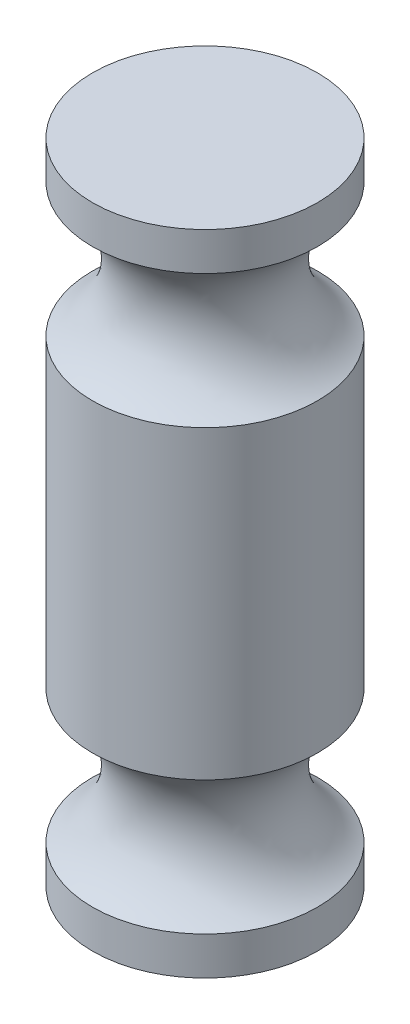
ISO-10303-21;
HEADER;
FILE_DESCRIPTION(('STEP AP214'),'2;1');
FILE_NAME('part.step','',(''),(''),'','','');
FILE_SCHEMA(('AUTOMOTIVE_DESIGN { 1 0 10303 214 1 1 1 1 }'));
ENDSEC;
DATA;
#1=APPLICATION_CONTEXT('core data for automotive mechanical design processes');
#2=APPLICATION_PROTOCOL_DEFINITION('international standard','automotive_design',2000,#1);
#3=PRODUCT_CONTEXT('',#1,'mechanical');
#4=PRODUCT('Part','Part','',(#3));
#5=PRODUCT_RELATED_PRODUCT_CATEGORY('part','',(#4));
#6=PRODUCT_DEFINITION_FORMATION('','',#4);
#7=PRODUCT_DEFINITION_CONTEXT('part definition',#1,'design');
#8=PRODUCT_DEFINITION('design','',#6,#7);
#9=PRODUCT_DEFINITION_SHAPE('','',#8);
#10=(LENGTH_UNIT() NAMED_UNIT(*) SI_UNIT(.MILLI.,.METRE.));
#11=(NAMED_UNIT(*) PLANE_ANGLE_UNIT() SI_UNIT($,.RADIAN.));
#12=(NAMED_UNIT(*) SI_UNIT($,.STERADIAN.) SOLID_ANGLE_UNIT());
#13=UNCERTAINTY_MEASURE_WITH_UNIT(LENGTH_MEASURE(1.E-05),#10,'distance_accuracy_value','');
#14=(GEOMETRIC_REPRESENTATION_CONTEXT(3) GLOBAL_UNCERTAINTY_ASSIGNED_CONTEXT((#13)) GLOBAL_UNIT_ASSIGNED_CONTEXT((#10,
#11,#12)) REPRESENTATION_CONTEXT('',''));
#15=CARTESIAN_POINT('',(0.,0.,0.));
#16=DIRECTION('',(0.,0.,1.));
#17=DIRECTION('',(1.,0.,0.));
#18=AXIS2_PLACEMENT_3D('',#15,#16,#17);
#19=CARTESIAN_POINT('',(2.95,-8.44,0.));
#20=DIRECTION('',(0.,-1.,0.));
#21=DIRECTION('',(0.,0.,-1.));
#22=AXIS2_PLACEMENT_3D('',#19,#20,#21);
#23=PLANE('',#22);
#24=CARTESIAN_POINT('',(0.,-8.44,0.));
#25=DIRECTION('',(0.,-1.,0.));
#26=DIRECTION('',(0.,0.,-1.));
#27=AXIS2_PLACEMENT_3D('',#24,#25,#26);
#28=CIRCLE('',#27,2.95);
#29=CARTESIAN_POINT('',(0.,-8.44,-2.95));
#30=VERTEX_POINT('',#29);
#31=EDGE_CURVE('E10',#30,#30,#28,.T.);
#32=ORIENTED_EDGE('',*,*,#31,.T.);
#33=EDGE_LOOP('',(#32));
#34=FACE_BOUND('',#33,.T.);
#35=ADVANCED_FACE('F34',(#34),#23,.T.);
#36=CARTESIAN_POINT('',(0.,-8.44,0.));
#37=DIRECTION('',(0.,-1.,0.));
#38=DIRECTION('',(0.,0.,-1.));
#39=AXIS2_PLACEMENT_3D('',#36,#37,#38);
#40=CYLINDRICAL_SURFACE('',#39,2.95);
#41=CARTESIAN_POINT('',(0.,-7.44,0.));
#42=DIRECTION('',(0.,-1.,0.));
#43=DIRECTION('',(0.,0.,-1.));
#44=AXIS2_PLACEMENT_3D('',#41,#42,#43);
#45=CIRCLE('',#44,2.95);
#46=CARTESIAN_POINT('',(0.,-7.44,-2.95));
#47=VERTEX_POINT('',#46);
#48=EDGE_CURVE('E40',#47,#47,#45,.T.);
#49=ORIENTED_EDGE('',*,*,#48,.T.);
#50=EDGE_LOOP('',(#49));
#51=FACE_BOUND('',#50,.T.);
#52=ORIENTED_EDGE('',*,*,#31,.F.);
#53=EDGE_LOOP('',(#52));
#54=FACE_BOUND('',#53,.T.);
#55=ADVANCED_FACE('F72',(#51,#54),#40,.T.);
#56=CARTESIAN_POINT('',(0.,-5.69,0.));
#57=DIRECTION('',(0.,-1.,0.));
#58=DIRECTION('',(0.,0.,-1.));
#59=AXIS2_PLACEMENT_3D('',#56,#57,#58);
#60=TOROIDAL_SURFACE('',#59,3.91824583655186,2.);
#61=CARTESIAN_POINT('',(0.,-3.94,0.));
#62=DIRECTION('',(0.,-1.,0.));
#63=DIRECTION('',(0.,0.,-1.));
#64=AXIS2_PLACEMENT_3D('',#61,#62,#63);
#65=CIRCLE('',#64,2.95);
#66=CARTESIAN_POINT('',(0.,-3.94,-2.95));
#67=VERTEX_POINT('',#66);
#68=EDGE_CURVE('E44',#67,#67,#65,.T.);
#69=ORIENTED_EDGE('',*,*,#68,.T.);
#70=EDGE_LOOP('',(#69));
#71=FACE_BOUND('',#70,.T.);
#72=ORIENTED_EDGE('',*,*,#48,.F.);
#73=EDGE_LOOP('',(#72));
#74=FACE_BOUND('',#73,.T.);
#75=ADVANCED_FACE('F76',(#71,#74),#60,.F.);
#76=CARTESIAN_POINT('',(0.,-8.44,0.));
#77=DIRECTION('',(0.,-1.,0.));
#78=DIRECTION('',(0.,0.,-1.));
#79=AXIS2_PLACEMENT_3D('',#76,#77,#78);
#80=CYLINDRICAL_SURFACE('',#79,2.95);
#81=CARTESIAN_POINT('',(0.,4.06,0.));
#82=DIRECTION('',(0.,-1.,0.));
#83=DIRECTION('',(0.,0.,-1.));
#84=AXIS2_PLACEMENT_3D('',#81,#82,#83);
#85=CIRCLE('',#84,2.95);
#86=CARTESIAN_POINT('',(0.,4.06,-2.95));
#87=VERTEX_POINT('',#86);
#88=EDGE_CURVE('E48',#87,#87,#85,.T.);
#89=ORIENTED_EDGE('',*,*,#88,.T.);
#90=EDGE_LOOP('',(#89));
#91=FACE_BOUND('',#90,.T.);
#92=ORIENTED_EDGE('',*,*,#68,.F.);
#93=EDGE_LOOP('',(#92));
#94=FACE_BOUND('',#93,.T.);
#95=ADVANCED_FACE('F80',(#91,#94),#80,.T.);
#96=CARTESIAN_POINT('',(0.,5.81,0.));
#97=DIRECTION('',(0.,-1.,0.));
#98=DIRECTION('',(0.,0.,-1.));
#99=AXIS2_PLACEMENT_3D('',#96,#97,#98);
#100=TOROIDAL_SURFACE('',#99,3.91824583655185,2.);
#101=CARTESIAN_POINT('',(0.,7.56,0.));
#102=DIRECTION('',(0.,-1.,0.));
#103=DIRECTION('',(0.,0.,-1.));
#104=AXIS2_PLACEMENT_3D('',#101,#102,#103);
#105=CIRCLE('',#104,2.95);
#106=CARTESIAN_POINT('',(0.,7.56,-2.95));
#107=VERTEX_POINT('',#106);
#108=EDGE_CURVE('E53',#107,#107,#105,.T.);
#109=ORIENTED_EDGE('',*,*,#108,.T.);
#110=EDGE_LOOP('',(#109));
#111=FACE_BOUND('',#110,.T.);
#112=ORIENTED_EDGE('',*,*,#88,.F.);
#113=EDGE_LOOP('',(#112));
#114=FACE_BOUND('',#113,.T.);
#115=ADVANCED_FACE('F69',(#111,#114),#100,.F.);
#116=CARTESIAN_POINT('',(0.,-8.44,0.));
#117=DIRECTION('',(0.,-1.,0.));
#118=DIRECTION('',(0.,0.,-1.));
#119=AXIS2_PLACEMENT_3D('',#116,#117,#118);
#120=CYLINDRICAL_SURFACE('',#119,2.95);
#121=CARTESIAN_POINT('',(0.,8.56,0.));
#122=DIRECTION('',(0.,-1.,0.));
#123=DIRECTION('',(0.,0.,-1.));
#124=AXIS2_PLACEMENT_3D('',#121,#122,#123);
#125=CIRCLE('',#124,2.95);
#126=CARTESIAN_POINT('',(0.,8.56,-2.95));
#127=VERTEX_POINT('',#126);
#128=EDGE_CURVE('E56',#127,#127,#125,.T.);
#129=ORIENTED_EDGE('',*,*,#128,.T.);
#130=EDGE_LOOP('',(#129));
#131=FACE_BOUND('',#130,.T.);
#132=ORIENTED_EDGE('',*,*,#108,.F.);
#133=EDGE_LOOP('',(#132));
#134=FACE_BOUND('',#133,.T.);
#135=ADVANCED_FACE('F60',(#131,#134),#120,.T.);
#136=CARTESIAN_POINT('',(0.,8.56,0.));
#137=DIRECTION('',(0.,1.,0.));
#138=DIRECTION('',(0.,0.,1.));
#139=AXIS2_PLACEMENT_3D('',#136,#137,#138);
#140=PLANE('',#139);
#141=ORIENTED_EDGE('',*,*,#128,.F.);
#142=EDGE_LOOP('',(#141));
#143=FACE_BOUND('',#142,.T.);
#144=ADVANCED_FACE('F63',(#143),#140,.T.);
#145=CLOSED_SHELL('',(#35,#55,#75,#95,#115,#135,#144));
#146=MANIFOLD_SOLID_BREP('B2',#145);
#147=ADVANCED_BREP_SHAPE_REPRESENTATION('',(#18,#146),#14);
#148=SHAPE_DEFINITION_REPRESENTATION(#9,#147);
ENDSEC;
END-ISO-10303-21;
